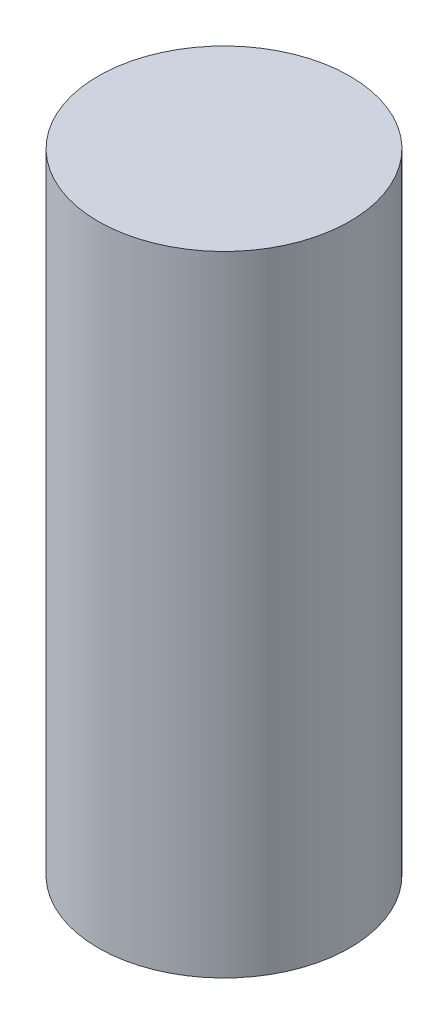
ISO-10303-21;
HEADER;
FILE_DESCRIPTION(('STEP AP214'),'2;1');
FILE_NAME('part.step','',(''),(''),'','','');
FILE_SCHEMA(('AUTOMOTIVE_DESIGN { 1 0 10303 214 1 1 1 1 }'));
ENDSEC;
DATA;
#1=APPLICATION_CONTEXT('core data for automotive mechanical design processes');
#2=APPLICATION_PROTOCOL_DEFINITION('international standard','automotive_design',2000,#1);
#3=PRODUCT_CONTEXT('',#1,'mechanical');
#4=PRODUCT('Part','Part','',(#3));
#5=PRODUCT_RELATED_PRODUCT_CATEGORY('part','',(#4));
#6=PRODUCT_DEFINITION_FORMATION('','',#4);
#7=PRODUCT_DEFINITION_CONTEXT('part definition',#1,'design');
#8=PRODUCT_DEFINITION('design','',#6,#7);
#9=PRODUCT_DEFINITION_SHAPE('','',#8);
#10=(LENGTH_UNIT() NAMED_UNIT(*) SI_UNIT(.MILLI.,.METRE.));
#11=(NAMED_UNIT(*) PLANE_ANGLE_UNIT() SI_UNIT($,.RADIAN.));
#12=(NAMED_UNIT(*) SI_UNIT($,.STERADIAN.) SOLID_ANGLE_UNIT());
#13=UNCERTAINTY_MEASURE_WITH_UNIT(LENGTH_MEASURE(1.E-05),#10,'distance_accuracy_value','');
#14=(GEOMETRIC_REPRESENTATION_CONTEXT(3) GLOBAL_UNCERTAINTY_ASSIGNED_CONTEXT((#13)) GLOBAL_UNIT_ASSIGNED_CONTEXT((#10,
#11,#12)) REPRESENTATION_CONTEXT('',''));
#15=CARTESIAN_POINT('',(0.,0.,0.));
#16=DIRECTION('',(0.,0.,1.));
#17=DIRECTION('',(1.,0.,0.));
#18=AXIS2_PLACEMENT_3D('',#15,#16,#17);
#19=CARTESIAN_POINT('',(0.,65.,0.));
#20=DIRECTION('',(0.,-1.,0.));
#21=DIRECTION('',(0.,0.,-1.));
#22=AXIS2_PLACEMENT_3D('',#19,#20,#21);
#23=CYLINDRICAL_SURFACE('',#22,13.);
#24=CARTESIAN_POINT('',(0.,65.,0.));
#25=DIRECTION('',(0.,1.,0.));
#26=DIRECTION('',(0.,0.,1.));
#27=AXIS2_PLACEMENT_3D('',#24,#25,#26);
#28=CIRCLE('',#27,13.);
#29=CARTESIAN_POINT('',(0.,65.,13.));
#30=VERTEX_POINT('',#29);
#31=EDGE_CURVE('E10',#30,#30,#28,.T.);
#32=ORIENTED_EDGE('',*,*,#31,.F.);
#33=EDGE_LOOP('',(#32));
#34=FACE_BOUND('',#33,.T.);
#35=CARTESIAN_POINT('',(0.,0.,0.));
#36=DIRECTION('',(0.,1.,0.));
#37=DIRECTION('',(0.,0.,1.));
#38=AXIS2_PLACEMENT_3D('',#35,#36,#37);
#39=CIRCLE('',#38,13.);
#40=CARTESIAN_POINT('',(0.,0.,13.));
#41=VERTEX_POINT('',#40);
#42=EDGE_CURVE('E34',#41,#41,#39,.T.);
#43=ORIENTED_EDGE('',*,*,#42,.T.);
#44=EDGE_LOOP('',(#43));
#45=FACE_BOUND('',#44,.T.);
#46=ADVANCED_FACE('F31',(#34,#45),#23,.T.);
#47=CARTESIAN_POINT('',(0.,65.,0.));
#48=DIRECTION('',(0.,1.,0.));
#49=DIRECTION('',(0.,0.,1.));
#50=AXIS2_PLACEMENT_3D('',#47,#48,#49);
#51=PLANE('',#50);
#52=ORIENTED_EDGE('',*,*,#31,.T.);
#53=EDGE_LOOP('',(#52));
#54=FACE_BOUND('',#53,.T.);
#55=ADVANCED_FACE('F46',(#54),#51,.T.);
#56=CARTESIAN_POINT('',(0.,0.,0.));
#57=DIRECTION('',(0.,1.,0.));
#58=DIRECTION('',(0.,0.,1.));
#59=AXIS2_PLACEMENT_3D('',#56,#57,#58);
#60=PLANE('',#59);
#61=ORIENTED_EDGE('',*,*,#42,.F.);
#62=EDGE_LOOP('',(#61));
#63=FACE_BOUND('',#62,.T.);
#64=ADVANCED_FACE('F44',(#63),#60,.F.);
#65=CLOSED_SHELL('',(#46,#55,#64));
#66=MANIFOLD_SOLID_BREP('B2',#65);
#67=ADVANCED_BREP_SHAPE_REPRESENTATION('',(#18,#66),#14);
#68=SHAPE_DEFINITION_REPRESENTATION(#9,#67);
ENDSEC;
END-ISO-10303-21;
